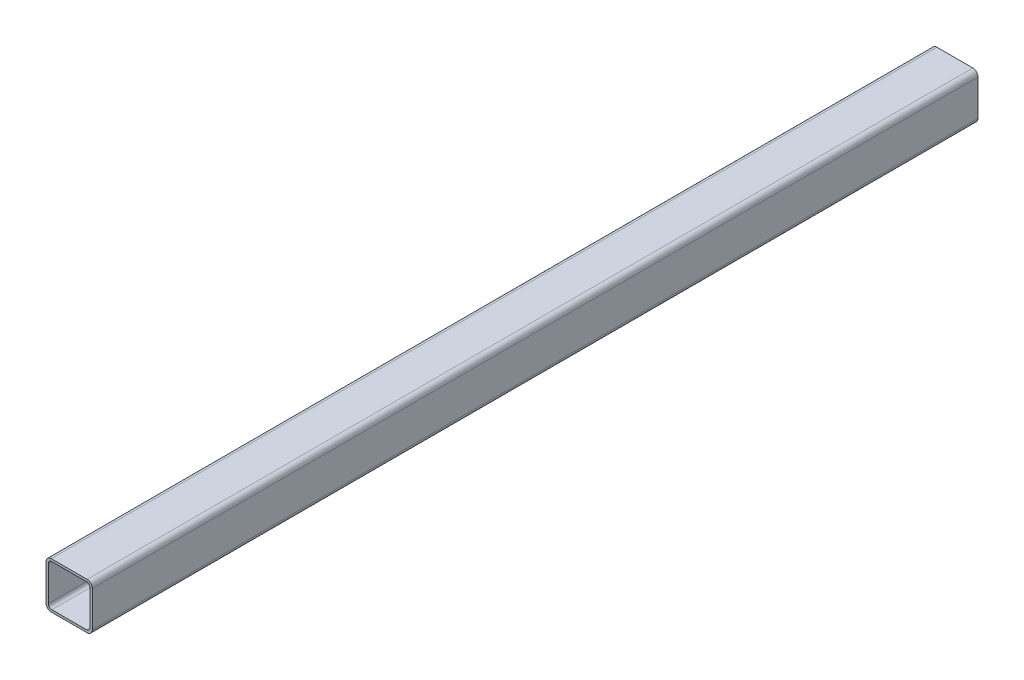
ISO-10303-21;
HEADER;
FILE_DESCRIPTION(('STEP AP214'),'2;1');
FILE_NAME('part.step','',(''),(''),'','','');
FILE_SCHEMA(('AUTOMOTIVE_DESIGN { 1 0 10303 214 1 1 1 1 }'));
ENDSEC;
DATA;
#1=APPLICATION_CONTEXT('core data for automotive mechanical design processes');
#2=APPLICATION_PROTOCOL_DEFINITION('international standard','automotive_design',2000,#1);
#3=PRODUCT_CONTEXT('',#1,'mechanical');
#4=PRODUCT('Part','Part','',(#3));
#5=PRODUCT_RELATED_PRODUCT_CATEGORY('part','',(#4));
#6=PRODUCT_DEFINITION_FORMATION('','',#4);
#7=PRODUCT_DEFINITION_CONTEXT('part definition',#1,'design');
#8=PRODUCT_DEFINITION('design','',#6,#7);
#9=PRODUCT_DEFINITION_SHAPE('','',#8);
#10=(LENGTH_UNIT() NAMED_UNIT(*) SI_UNIT(.MILLI.,.METRE.));
#11=(NAMED_UNIT(*) PLANE_ANGLE_UNIT() SI_UNIT($,.RADIAN.));
#12=(NAMED_UNIT(*) SI_UNIT($,.STERADIAN.) SOLID_ANGLE_UNIT());
#13=UNCERTAINTY_MEASURE_WITH_UNIT(LENGTH_MEASURE(1.E-05),#10,'distance_accuracy_value','');
#14=(GEOMETRIC_REPRESENTATION_CONTEXT(3) GLOBAL_UNCERTAINTY_ASSIGNED_CONTEXT((#13)) GLOBAL_UNIT_ASSIGNED_CONTEXT((#10,
#11,#12)) REPRESENTATION_CONTEXT('',''));
#15=CARTESIAN_POINT('',(0.,0.,0.));
#16=DIRECTION('',(0.,0.,1.));
#17=DIRECTION('',(1.,0.,0.));
#18=AXIS2_PLACEMENT_3D('',#15,#16,#17);
#19=CARTESIAN_POINT('',(-15.4999999999998,1249.00000000001,-2383.));
#20=DIRECTION('',(0.,1.00000000000001,0.));
#21=DIRECTION('',(0.,0.,1.));
#22=AXIS2_PLACEMENT_3D('',#19,#20,#21);
#23=PLANE('',#22);
#24=DIRECTION('',(-0.999999999999997,0.,0.));
#25=VECTOR('',#24,1.);
#26=CARTESIAN_POINT('',(-15.5000000000003,1249.00000000001,-2363.));
#27=LINE('',#26,#25);
#28=CARTESIAN_POINT('',(15.4999999999996,1249.00000000001,-2363.));
#29=VERTEX_POINT('',#28);
#30=CARTESIAN_POINT('',(-15.5000000000003,1249.00000000001,-2363.));
#31=VERTEX_POINT('',#30);
#32=EDGE_CURVE('E273',#29,#31,#27,.T.);
#33=ORIENTED_EDGE('',*,*,#32,.F.);
#34=DIRECTION('',(0.,0.,1.));
#35=VECTOR('',#34,1.);
#36=CARTESIAN_POINT('',(15.4999999999998,1249.00000000001,-2383.));
#37=LINE('',#36,#35);
#38=CARTESIAN_POINT('',(15.4999999999978,1249.00000000001,-1597.));
#39=VERTEX_POINT('',#38);
#40=EDGE_CURVE('E337',#29,#39,#37,.T.);
#41=ORIENTED_EDGE('',*,*,#40,.T.);
#42=DIRECTION('',(0.999999999999997,0.,0.));
#43=VECTOR('',#42,1.);
#44=CARTESIAN_POINT('',(-15.5000000000021,1249.00000000001,-1597.));
#45=LINE('',#44,#43);
#46=CARTESIAN_POINT('',(-15.5000000000021,1249.00000000001,-1597.));
#47=VERTEX_POINT('',#46);
#48=EDGE_CURVE('E204',#47,#39,#45,.T.);
#49=ORIENTED_EDGE('',*,*,#48,.F.);
#50=DIRECTION('',(0.,0.,1.));
#51=VECTOR('',#50,1.);
#52=CARTESIAN_POINT('',(-15.4999999999998,1249.00000000001,-2383.));
#53=LINE('',#52,#51);
#54=EDGE_CURVE('E47',#31,#47,#53,.T.);
#55=ORIENTED_EDGE('',*,*,#54,.F.);
#56=EDGE_LOOP('',(#33,#41,#49,#55));
#57=FACE_BOUND('',#56,.T.);
#58=ADVANCED_FACE('F43',(#57),#23,.F.);
#59=CARTESIAN_POINT('',(15.4999999999998,1253.50000000001,-2383.));
#60=DIRECTION('',(0.,0.,1.));
#61=DIRECTION('',(0.999999999999997,0.,0.));
#62=AXIS2_PLACEMENT_3D('',#59,#60,#61);
#63=CYLINDRICAL_SURFACE('',#62,4.5);
#64=CARTESIAN_POINT('',(15.4999999999996,1253.50000000001,-2363.));
#65=DIRECTION('',(0.,0.,-1.));
#66=DIRECTION('',(0.,1.00000000000001,0.));
#67=AXIS2_PLACEMENT_3D('',#64,#65,#66);
#68=CIRCLE('',#67,4.5);
#69=CARTESIAN_POINT('',(19.9999999999998,1253.50000000001,-2363.));
#70=VERTEX_POINT('',#69);
#71=EDGE_CURVE('E266',#70,#29,#68,.T.);
#72=ORIENTED_EDGE('',*,*,#71,.F.);
#73=DIRECTION('',(0.,0.,1.));
#74=VECTOR('',#73,1.);
#75=CARTESIAN_POINT('',(19.9999999999998,1253.50000000001,-2383.));
#76=LINE('',#75,#74);
#77=CARTESIAN_POINT('',(19.9999999999996,1253.50000000001,-1597.));
#78=VERTEX_POINT('',#77);
#79=EDGE_CURVE('E307',#70,#78,#76,.T.);
#80=ORIENTED_EDGE('',*,*,#79,.T.);
#81=CARTESIAN_POINT('',(15.4999999999996,1253.50000000001,-1597.));
#82=DIRECTION('',(0.,0.,1.));
#83=DIRECTION('',(0.,-1.00000000000001,0.));
#84=AXIS2_PLACEMENT_3D('',#81,#82,#83);
#85=CIRCLE('',#84,4.5);
#86=EDGE_CURVE('E210',#39,#78,#85,.T.);
#87=ORIENTED_EDGE('',*,*,#86,.F.);
#88=ORIENTED_EDGE('',*,*,#40,.F.);
#89=EDGE_LOOP('',(#72,#80,#87,#88));
#90=FACE_BOUND('',#89,.T.);
#91=ADVANCED_FACE('F348',(#90),#63,.T.);
#92=CARTESIAN_POINT('',(19.9999999999998,1253.50000000001,-2383.));
#93=DIRECTION('',(-0.999999999999997,0.,0.));
#94=DIRECTION('',(0.,0.,1.));
#95=AXIS2_PLACEMENT_3D('',#92,#93,#94);
#96=PLANE('',#95);
#97=DIRECTION('',(0.,1.00000000000001,0.));
#98=VECTOR('',#97,1.);
#99=CARTESIAN_POINT('',(19.9999999999994,3.88578058618805E-12,-2363.));
#100=LINE('',#99,#98);
#101=CARTESIAN_POINT('',(19.9999999999998,1284.50000000001,-2363.));
#102=VERTEX_POINT('',#101);
#103=EDGE_CURVE('E303',#70,#102,#100,.T.);
#104=ORIENTED_EDGE('',*,*,#103,.T.);
#105=DIRECTION('',(0.,0.,1.));
#106=VECTOR('',#105,1.);
#107=CARTESIAN_POINT('',(20.000000000002,1284.50000000001,-2383.));
#108=LINE('',#107,#106);
#109=CARTESIAN_POINT('',(20.,1284.50000000001,-1597.));
#110=VERTEX_POINT('',#109);
#111=EDGE_CURVE('E306',#102,#110,#108,.T.);
#112=ORIENTED_EDGE('',*,*,#111,.T.);
#113=DIRECTION('',(0.,1.00000000000001,0.));
#114=VECTOR('',#113,1.);
#115=CARTESIAN_POINT('',(19.9999999999996,2.22044604925031E-12,-1597.));
#116=LINE('',#115,#114);
#117=EDGE_CURVE('E220',#78,#110,#116,.T.);
#118=ORIENTED_EDGE('',*,*,#117,.F.);
#119=ORIENTED_EDGE('',*,*,#79,.F.);
#120=EDGE_LOOP('',(#104,#112,#118,#119));
#121=FACE_BOUND('',#120,.T.);
#122=ADVANCED_FACE('F351',(#121),#96,.F.);
#123=CARTESIAN_POINT('',(15.5000000000021,1284.50000000001,-2383.));
#124=DIRECTION('',(0.,0.,1.));
#125=DIRECTION('',(0.999999999999997,0.,0.));
#126=AXIS2_PLACEMENT_3D('',#123,#124,#125);
#127=CYLINDRICAL_SURFACE('',#126,4.5);
#128=CARTESIAN_POINT('',(15.4999999999998,1284.50000000001,-2363.));
#129=DIRECTION('',(0.,0.,-1.));
#130=DIRECTION('',(0.,1.00000000000001,0.));
#131=AXIS2_PLACEMENT_3D('',#128,#129,#130);
#132=CIRCLE('',#131,4.5);
#133=CARTESIAN_POINT('',(15.4999999999998,1289.00000000001,-2363.));
#134=VERTEX_POINT('',#133);
#135=EDGE_CURVE('E102',#134,#102,#132,.T.);
#136=ORIENTED_EDGE('',*,*,#135,.F.);
#137=DIRECTION('',(0.,0.,1.));
#138=VECTOR('',#137,1.);
#139=CARTESIAN_POINT('',(15.5000000000021,1289.00000000001,-2383.));
#140=LINE('',#139,#138);
#141=CARTESIAN_POINT('',(15.5000000000001,1289.00000000001,-1597.));
#142=VERTEX_POINT('',#141);
#143=EDGE_CURVE('E331',#134,#142,#140,.T.);
#144=ORIENTED_EDGE('',*,*,#143,.T.);
#145=CARTESIAN_POINT('',(15.5000000000001,1284.50000000001,-1597.));
#146=DIRECTION('',(0.,0.,1.));
#147=DIRECTION('',(0.,-1.00000000000001,0.));
#148=AXIS2_PLACEMENT_3D('',#145,#146,#147);
#149=CIRCLE('',#148,4.5);
#150=EDGE_CURVE('E216',#110,#142,#149,.T.);
#151=ORIENTED_EDGE('',*,*,#150,.F.);
#152=ORIENTED_EDGE('',*,*,#111,.F.);
#153=EDGE_LOOP('',(#136,#144,#151,#152));
#154=FACE_BOUND('',#153,.T.);
#155=ADVANCED_FACE('F357',(#154),#127,.T.);
#156=CARTESIAN_POINT('',(-15.4999999999981,1289.00000000001,-2383.));
#157=DIRECTION('',(0.,-1.00000000000001,0.));
#158=DIRECTION('',(0.,0.,-1.));
#159=AXIS2_PLACEMENT_3D('',#156,#157,#158);
#160=PLANE('',#159);
#161=DIRECTION('',(0.999999999999997,0.,0.));
#162=VECTOR('',#161,1.);
#163=CARTESIAN_POINT('',(-15.4999999999998,1289.00000000001,-2363.));
#164=LINE('',#163,#162);
#165=CARTESIAN_POINT('',(-15.4999999999998,1289.00000000001,-2363.));
#166=VERTEX_POINT('',#165);
#167=EDGE_CURVE('E11',#166,#134,#164,.T.);
#168=ORIENTED_EDGE('',*,*,#167,.F.);
#169=DIRECTION('',(0.,0.,1.));
#170=VECTOR('',#169,1.);
#171=CARTESIAN_POINT('',(-15.4999999999981,1289.00000000001,-2383.));
#172=LINE('',#171,#170);
#173=CARTESIAN_POINT('',(-15.5000000000001,1289.00000000001,-1597.));
#174=VERTEX_POINT('',#173);
#175=EDGE_CURVE('E328',#166,#174,#172,.T.);
#176=ORIENTED_EDGE('',*,*,#175,.T.);
#177=DIRECTION('',(-0.999999999999997,0.,0.));
#178=VECTOR('',#177,1.);
#179=CARTESIAN_POINT('',(-15.5000000000001,1289.00000000001,-1597.));
#180=LINE('',#179,#178);
#181=EDGE_CURVE('E267',#142,#174,#180,.T.);
#182=ORIENTED_EDGE('',*,*,#181,.F.);
#183=ORIENTED_EDGE('',*,*,#143,.F.);
#184=EDGE_LOOP('',(#168,#176,#182,#183));
#185=FACE_BOUND('',#184,.T.);
#186=ADVANCED_FACE('F450',(#185),#160,.F.);
#187=CARTESIAN_POINT('',(-15.4999999999981,1284.50000000001,-2383.));
#188=DIRECTION('',(0.,0.,1.));
#189=DIRECTION('',(0.999999999999997,0.,0.));
#190=AXIS2_PLACEMENT_3D('',#187,#188,#189);
#191=CYLINDRICAL_SURFACE('',#190,4.5);
#192=CARTESIAN_POINT('',(-15.5000000000001,1284.50000000001,-2363.));
#193=DIRECTION('',(0.,0.,-1.));
#194=DIRECTION('',(0.,1.00000000000001,0.));
#195=AXIS2_PLACEMENT_3D('',#192,#193,#194);
#196=CIRCLE('',#195,4.5);
#197=CARTESIAN_POINT('',(-20.,1284.50000000001,-2363.00000000001));
#198=VERTEX_POINT('',#197);
#199=EDGE_CURVE('E54',#198,#166,#196,.T.);
#200=ORIENTED_EDGE('',*,*,#199,.F.);
#201=DIRECTION('',(0.,0.,1.));
#202=VECTOR('',#201,1.);
#203=CARTESIAN_POINT('',(-19.999999999998,1284.50000000001,-2383.00000000001));
#204=LINE('',#203,#202);
#205=CARTESIAN_POINT('',(-20.,1284.50000000001,-1597.));
#206=VERTEX_POINT('',#205);
#207=EDGE_CURVE('E173',#198,#206,#204,.T.);
#208=ORIENTED_EDGE('',*,*,#207,.T.);
#209=CARTESIAN_POINT('',(-15.5000000000001,1284.50000000001,-1597.));
#210=DIRECTION('',(0.,0.,1.));
#211=DIRECTION('',(0.,-1.00000000000001,0.));
#212=AXIS2_PLACEMENT_3D('',#209,#210,#211);
#213=CIRCLE('',#212,4.5);
#214=EDGE_CURVE('E198',#174,#206,#213,.T.);
#215=ORIENTED_EDGE('',*,*,#214,.F.);
#216=ORIENTED_EDGE('',*,*,#175,.F.);
#217=EDGE_LOOP('',(#200,#208,#215,#216));
#218=FACE_BOUND('',#217,.T.);
#219=ADVANCED_FACE('F445',(#218),#191,.T.);
#220=CARTESIAN_POINT('',(-19.9999999999998,1253.50000000001,-2383.00000000001));
#221=DIRECTION('',(0.999999999999997,0.,0.));
#222=DIRECTION('',(0.,0.,-1.));
#223=AXIS2_PLACEMENT_3D('',#220,#221,#222);
#224=PLANE('',#223);
#225=DIRECTION('',(0.,1.00000000000001,0.));
#226=VECTOR('',#225,1.);
#227=CARTESIAN_POINT('',(-20.0000000000005,4.9960036108132E-12,-2363.));
#228=LINE('',#227,#226);
#229=CARTESIAN_POINT('',(-20.0000000000002,1253.50000000001,-2363.00000000001));
#230=VERTEX_POINT('',#229);
#231=EDGE_CURVE('E185',#230,#198,#228,.T.);
#232=ORIENTED_EDGE('',*,*,#231,.F.);
#233=DIRECTION('',(0.,0.,1.));
#234=VECTOR('',#233,1.);
#235=CARTESIAN_POINT('',(-19.9999999999998,1253.50000000001,-2383.00000000001));
#236=LINE('',#235,#234);
#237=CARTESIAN_POINT('',(-20.,1253.50000000001,-1597.));
#238=VERTEX_POINT('',#237);
#239=EDGE_CURVE('E181',#230,#238,#236,.T.);
#240=ORIENTED_EDGE('',*,*,#239,.T.);
#241=DIRECTION('',(0.,1.00000000000001,0.));
#242=VECTOR('',#241,1.);
#243=CARTESIAN_POINT('',(-20.0000000000005,3.33066907387547E-12,-1597.));
#244=LINE('',#243,#242);
#245=EDGE_CURVE('E184',#238,#206,#244,.T.);
#246=ORIENTED_EDGE('',*,*,#245,.T.);
#247=ORIENTED_EDGE('',*,*,#207,.F.);
#248=EDGE_LOOP('',(#232,#240,#246,#247));
#249=FACE_BOUND('',#248,.T.);
#250=ADVANCED_FACE('F183',(#249),#224,.F.);
#251=CARTESIAN_POINT('',(-15.4999999999998,1253.50000000001,-2383.));
#252=DIRECTION('',(0.,0.,1.));
#253=DIRECTION('',(0.999999999999997,0.,0.));
#254=AXIS2_PLACEMENT_3D('',#251,#252,#253);
#255=CYLINDRICAL_SURFACE('',#254,4.5);
#256=CARTESIAN_POINT('',(-15.5000000000003,1253.50000000001,-2363.));
#257=DIRECTION('',(0.,0.,-1.));
#258=DIRECTION('',(0.,1.00000000000001,0.));
#259=AXIS2_PLACEMENT_3D('',#256,#257,#258);
#260=CIRCLE('',#259,4.5);
#261=EDGE_CURVE('E277',#31,#230,#260,.T.);
#262=ORIENTED_EDGE('',*,*,#261,.F.);
#263=ORIENTED_EDGE('',*,*,#54,.T.);
#264=CARTESIAN_POINT('',(-15.5000000000001,1253.50000000001,-1597.));
#265=DIRECTION('',(0.,0.,1.));
#266=DIRECTION('',(0.,-1.00000000000001,0.));
#267=AXIS2_PLACEMENT_3D('',#264,#265,#266);
#268=CIRCLE('',#267,4.5);
#269=EDGE_CURVE('E195',#238,#47,#268,.T.);
#270=ORIENTED_EDGE('',*,*,#269,.F.);
#271=ORIENTED_EDGE('',*,*,#239,.F.);
#272=EDGE_LOOP('',(#262,#263,#270,#271));
#273=FACE_BOUND('',#272,.T.);
#274=ADVANCED_FACE('F201',(#273),#255,.T.);
#275=CARTESIAN_POINT('',(-17.9999999999998,1254.00000000001,-2383.));
#276=DIRECTION('',(0.999999999999997,0.,0.));
#277=DIRECTION('',(0.,0.,-1.));
#278=AXIS2_PLACEMENT_3D('',#275,#276,#277);
#279=PLANE('',#278);
#280=DIRECTION('',(0.,0.,1.));
#281=VECTOR('',#280,1.);
#282=CARTESIAN_POINT('',(-17.9999999999998,1254.00000000001,-2383.));
#283=LINE('',#282,#281);
#284=CARTESIAN_POINT('',(-18.0000000000002,1254.00000000001,-2363.));
#285=VERTEX_POINT('',#284);
#286=CARTESIAN_POINT('',(-18.,1254.00000000001,-1597.));
#287=VERTEX_POINT('',#286);
#288=EDGE_CURVE('E225',#285,#287,#283,.T.);
#289=ORIENTED_EDGE('',*,*,#288,.F.);
#290=DIRECTION('',(0.,1.00000000000001,0.));
#291=VECTOR('',#290,1.);
#292=CARTESIAN_POINT('',(-18.0000000000002,1254.00000000001,-2363.));
#293=LINE('',#292,#291);
#294=CARTESIAN_POINT('',(-18.,1284.00000000001,-2363.));
#295=VERTEX_POINT('',#294);
#296=EDGE_CURVE('E108',#285,#295,#293,.T.);
#297=ORIENTED_EDGE('',*,*,#296,.T.);
#298=DIRECTION('',(0.,0.,1.));
#299=VECTOR('',#298,1.);
#300=CARTESIAN_POINT('',(-17.999999999998,1284.00000000001,-2383.));
#301=LINE('',#300,#299);
#302=CARTESIAN_POINT('',(-18.,1284.00000000001,-1597.));
#303=VERTEX_POINT('',#302);
#304=EDGE_CURVE('E282',#295,#303,#301,.T.);
#305=ORIENTED_EDGE('',*,*,#304,.T.);
#306=DIRECTION('',(0.,-1.00000000000001,0.));
#307=VECTOR('',#306,1.);
#308=CARTESIAN_POINT('',(-18.,1254.00000000001,-1597.));
#309=LINE('',#308,#307);
#310=EDGE_CURVE('E287',#303,#287,#309,.T.);
#311=ORIENTED_EDGE('',*,*,#310,.T.);
#312=EDGE_LOOP('',(#289,#297,#305,#311));
#313=FACE_BOUND('',#312,.T.);
#314=ADVANCED_FACE('F45',(#313),#279,.T.);
#315=CARTESIAN_POINT('',(-14.9999999999979,1284.00000000001,-2383.));
#316=DIRECTION('',(0.,0.,1.));
#317=DIRECTION('',(0.999999999999997,0.,0.));
#318=AXIS2_PLACEMENT_3D('',#315,#316,#317);
#319=CYLINDRICAL_SURFACE('',#318,3.);
#320=ORIENTED_EDGE('',*,*,#304,.F.);
#321=CARTESIAN_POINT('',(-15.0000000000001,1284.00000000001,-2363.));
#322=DIRECTION('',(0.,0.,-1.));
#323=DIRECTION('',(0.,1.00000000000001,0.));
#324=AXIS2_PLACEMENT_3D('',#321,#322,#323);
#325=CIRCLE('',#324,3.);
#326=CARTESIAN_POINT('',(-14.9999999999999,1287.00000000001,-2363.));
#327=VERTEX_POINT('',#326);
#328=EDGE_CURVE('E283',#295,#327,#325,.T.);
#329=ORIENTED_EDGE('',*,*,#328,.T.);
#330=DIRECTION('',(0.,0.,1.));
#331=VECTOR('',#330,1.);
#332=CARTESIAN_POINT('',(-14.9999999999979,1287.00000000001,-2383.));
#333=LINE('',#332,#331);
#334=CARTESIAN_POINT('',(-14.9999999999999,1287.00000000001,-1597.));
#335=VERTEX_POINT('',#334);
#336=EDGE_CURVE('E260',#327,#335,#333,.T.);
#337=ORIENTED_EDGE('',*,*,#336,.T.);
#338=CARTESIAN_POINT('',(-14.9999999999999,1284.00000000001,-1597.));
#339=DIRECTION('',(0.,0.,1.));
#340=DIRECTION('',(0.,-1.00000000000001,0.));
#341=AXIS2_PLACEMENT_3D('',#338,#339,#340);
#342=CIRCLE('',#341,3.);
#343=EDGE_CURVE('E256',#335,#303,#342,.T.);
#344=ORIENTED_EDGE('',*,*,#343,.T.);
#345=EDGE_LOOP('',(#320,#329,#337,#344));
#346=FACE_BOUND('',#345,.T.);
#347=ADVANCED_FACE('F384',(#346),#319,.F.);
#348=CARTESIAN_POINT('',(-14.9999999999979,1287.00000000001,-2383.));
#349=DIRECTION('',(0.,-1.00000000000001,0.));
#350=DIRECTION('',(0.,0.,-1.));
#351=AXIS2_PLACEMENT_3D('',#348,#349,#350);
#352=PLANE('',#351);
#353=ORIENTED_EDGE('',*,*,#336,.F.);
#354=DIRECTION('',(0.999999999999997,0.,0.));
#355=VECTOR('',#354,1.);
#356=CARTESIAN_POINT('',(-14.9999999999999,1287.00000000001,-2363.));
#357=LINE('',#356,#355);
#358=CARTESIAN_POINT('',(14.9999999999999,1287.00000000001,-2363.00000000001));
#359=VERTEX_POINT('',#358);
#360=EDGE_CURVE('E259',#327,#359,#357,.T.);
#361=ORIENTED_EDGE('',*,*,#360,.T.);
#362=DIRECTION('',(0.,0.,1.));
#363=VECTOR('',#362,1.);
#364=CARTESIAN_POINT('',(15.0000000000019,1287.00000000001,-2383.00000000001));
#365=LINE('',#364,#363);
#366=CARTESIAN_POINT('',(15.0000000000001,1287.00000000001,-1597.));
#367=VERTEX_POINT('',#366);
#368=EDGE_CURVE('E255',#359,#367,#365,.T.);
#369=ORIENTED_EDGE('',*,*,#368,.T.);
#370=DIRECTION('',(-0.999999999999997,0.,0.));
#371=VECTOR('',#370,1.);
#372=CARTESIAN_POINT('',(-14.9999999999999,1287.00000000001,-1597.));
#373=LINE('',#372,#371);
#374=EDGE_CURVE('E250',#367,#335,#373,.T.);
#375=ORIENTED_EDGE('',*,*,#374,.T.);
#376=EDGE_LOOP('',(#353,#361,#369,#375));
#377=FACE_BOUND('',#376,.T.);
#378=ADVANCED_FACE('F387',(#377),#352,.T.);
#379=CARTESIAN_POINT('',(15.0000000000019,1284.00000000001,-2383.00000000001));
#380=DIRECTION('',(0.,0.,1.));
#381=DIRECTION('',(0.999999999999997,0.,0.));
#382=AXIS2_PLACEMENT_3D('',#379,#380,#381);
#383=CYLINDRICAL_SURFACE('',#382,3.);
#384=ORIENTED_EDGE('',*,*,#368,.F.);
#385=CARTESIAN_POINT('',(14.9999999999999,1284.00000000001,-2363.00000000001));
#386=DIRECTION('',(0.,0.,-1.));
#387=DIRECTION('',(0.,1.00000000000001,0.));
#388=AXIS2_PLACEMENT_3D('',#385,#386,#387);
#389=CIRCLE('',#388,3.);
#390=CARTESIAN_POINT('',(17.9999999999998,1284.00000000001,-2363.00000000001));
#391=VERTEX_POINT('',#390);
#392=EDGE_CURVE('E254',#359,#391,#389,.T.);
#393=ORIENTED_EDGE('',*,*,#392,.T.);
#394=DIRECTION('',(0.,0.,1.));
#395=VECTOR('',#394,1.);
#396=CARTESIAN_POINT('',(18.000000000002,1284.00000000001,-2383.00000000001));
#397=LINE('',#396,#395);
#398=CARTESIAN_POINT('',(18.,1284.00000000001,-1597.));
#399=VERTEX_POINT('',#398);
#400=EDGE_CURVE('E249',#391,#399,#397,.T.);
#401=ORIENTED_EDGE('',*,*,#400,.T.);
#402=CARTESIAN_POINT('',(14.9999999999999,1284.00000000001,-1597.));
#403=DIRECTION('',(0.,0.,1.));
#404=DIRECTION('',(0.,-1.00000000000001,0.));
#405=AXIS2_PLACEMENT_3D('',#402,#403,#404);
#406=CIRCLE('',#405,3.);
#407=EDGE_CURVE('E244',#399,#367,#406,.T.);
#408=ORIENTED_EDGE('',*,*,#407,.T.);
#409=EDGE_LOOP('',(#384,#393,#401,#408));
#410=FACE_BOUND('',#409,.T.);
#411=ADVANCED_FACE('F392',(#410),#383,.F.);
#412=CARTESIAN_POINT('',(17.9999999999998,1254.00000000001,-2383.00000000001));
#413=DIRECTION('',(-0.999999999999997,0.,0.));
#414=DIRECTION('',(0.,0.,1.));
#415=AXIS2_PLACEMENT_3D('',#412,#413,#414);
#416=PLANE('',#415);
#417=ORIENTED_EDGE('',*,*,#400,.F.);
#418=DIRECTION('',(0.,-1.00000000000001,0.));
#419=VECTOR('',#418,1.);
#420=CARTESIAN_POINT('',(17.9999999999998,1254.00000000001,-2363.00000000001));
#421=LINE('',#420,#419);
#422=CARTESIAN_POINT('',(17.9999999999998,1254.00000000001,-2363.00000000001));
#423=VERTEX_POINT('',#422);
#424=EDGE_CURVE('E248',#391,#423,#421,.T.);
#425=ORIENTED_EDGE('',*,*,#424,.T.);
#426=DIRECTION('',(0.,0.,1.));
#427=VECTOR('',#426,1.);
#428=CARTESIAN_POINT('',(17.9999999999998,1254.00000000001,-2383.00000000001));
#429=LINE('',#428,#427);
#430=CARTESIAN_POINT('',(17.9999999999996,1254.00000000001,-1597.));
#431=VERTEX_POINT('',#430);
#432=EDGE_CURVE('E243',#423,#431,#429,.T.);
#433=ORIENTED_EDGE('',*,*,#432,.T.);
#434=DIRECTION('',(0.,1.00000000000001,0.));
#435=VECTOR('',#434,1.);
#436=CARTESIAN_POINT('',(17.9999999999996,1254.00000000001,-1597.));
#437=LINE('',#436,#435);
#438=EDGE_CURVE('E238',#431,#399,#437,.T.);
#439=ORIENTED_EDGE('',*,*,#438,.T.);
#440=EDGE_LOOP('',(#417,#425,#433,#439));
#441=FACE_BOUND('',#440,.T.);
#442=ADVANCED_FACE('F395',(#441),#416,.T.);
#443=CARTESIAN_POINT('',(14.9999999999999,1254.00000000001,-2383.00000000001));
#444=DIRECTION('',(0.,0.,1.));
#445=DIRECTION('',(0.999999999999997,0.,0.));
#446=AXIS2_PLACEMENT_3D('',#443,#444,#445);
#447=CYLINDRICAL_SURFACE('',#446,3.);
#448=ORIENTED_EDGE('',*,*,#432,.F.);
#449=CARTESIAN_POINT('',(14.9999999999997,1254.00000000001,-2363.00000000001));
#450=DIRECTION('',(0.,0.,-1.));
#451=DIRECTION('',(0.,1.00000000000001,0.));
#452=AXIS2_PLACEMENT_3D('',#449,#450,#451);
#453=CIRCLE('',#452,3.);
#454=CARTESIAN_POINT('',(14.9999999999997,1251.00000000001,-2363.00000000001));
#455=VERTEX_POINT('',#454);
#456=EDGE_CURVE('E242',#423,#455,#453,.T.);
#457=ORIENTED_EDGE('',*,*,#456,.T.);
#458=DIRECTION('',(0.,0.,1.));
#459=VECTOR('',#458,1.);
#460=CARTESIAN_POINT('',(14.9999999999999,1251.00000000001,-2383.00000000001));
#461=LINE('',#460,#459);
#462=CARTESIAN_POINT('',(14.9999999999979,1251.00000000001,-1597.));
#463=VERTEX_POINT('',#462);
#464=EDGE_CURVE('E237',#455,#463,#461,.T.);
#465=ORIENTED_EDGE('',*,*,#464,.T.);
#466=CARTESIAN_POINT('',(14.9999999999997,1254.00000000001,-1597.));
#467=DIRECTION('',(0.,0.,1.));
#468=DIRECTION('',(0.,-1.00000000000001,0.));
#469=AXIS2_PLACEMENT_3D('',#466,#467,#468);
#470=CIRCLE('',#469,3.);
#471=EDGE_CURVE('E232',#463,#431,#470,.T.);
#472=ORIENTED_EDGE('',*,*,#471,.T.);
#473=EDGE_LOOP('',(#448,#457,#465,#472));
#474=FACE_BOUND('',#473,.T.);
#475=ADVANCED_FACE('F399',(#474),#447,.F.);
#476=CARTESIAN_POINT('',(-14.9999999999999,1251.00000000001,-2383.));
#477=DIRECTION('',(0.,1.00000000000001,0.));
#478=DIRECTION('',(0.,0.,1.));
#479=AXIS2_PLACEMENT_3D('',#476,#477,#478);
#480=PLANE('',#479);
#481=ORIENTED_EDGE('',*,*,#464,.F.);
#482=DIRECTION('',(-0.999999999999997,0.,0.));
#483=VECTOR('',#482,1.);
#484=CARTESIAN_POINT('',(-15.0000000000003,1251.00000000001,-2363.));
#485=LINE('',#484,#483);
#486=CARTESIAN_POINT('',(-15.0000000000003,1251.00000000001,-2363.));
#487=VERTEX_POINT('',#486);
#488=EDGE_CURVE('E236',#455,#487,#485,.T.);
#489=ORIENTED_EDGE('',*,*,#488,.T.);
#490=DIRECTION('',(0.,0.,1.));
#491=VECTOR('',#490,1.);
#492=CARTESIAN_POINT('',(-14.9999999999999,1251.00000000001,-2383.));
#493=LINE('',#492,#491);
#494=CARTESIAN_POINT('',(-15.0000000000021,1251.00000000001,-1597.));
#495=VERTEX_POINT('',#494);
#496=EDGE_CURVE('E231',#487,#495,#493,.T.);
#497=ORIENTED_EDGE('',*,*,#496,.T.);
#498=DIRECTION('',(0.999999999999997,0.,0.));
#499=VECTOR('',#498,1.);
#500=CARTESIAN_POINT('',(-15.0000000000021,1251.00000000001,-1597.));
#501=LINE('',#500,#499);
#502=EDGE_CURVE('E226',#495,#463,#501,.T.);
#503=ORIENTED_EDGE('',*,*,#502,.T.);
#504=EDGE_LOOP('',(#481,#489,#497,#503));
#505=FACE_BOUND('',#504,.T.);
#506=ADVANCED_FACE('F402',(#505),#480,.T.);
#507=CARTESIAN_POINT('',(-14.9999999999999,1254.00000000001,-2383.));
#508=DIRECTION('',(0.,0.,1.));
#509=DIRECTION('',(0.999999999999997,0.,0.));
#510=AXIS2_PLACEMENT_3D('',#507,#508,#509);
#511=CYLINDRICAL_SURFACE('',#510,3.);
#512=ORIENTED_EDGE('',*,*,#496,.F.);
#513=CARTESIAN_POINT('',(-15.0000000000003,1254.00000000001,-2363.));
#514=DIRECTION('',(0.,0.,-1.));
#515=DIRECTION('',(0.,1.00000000000001,0.));
#516=AXIS2_PLACEMENT_3D('',#513,#514,#515);
#517=CIRCLE('',#516,3.);
#518=EDGE_CURVE('E230',#487,#285,#517,.T.);
#519=ORIENTED_EDGE('',*,*,#518,.T.);
#520=ORIENTED_EDGE('',*,*,#288,.T.);
#521=CARTESIAN_POINT('',(-15.0000000000001,1254.00000000001,-1597.));
#522=DIRECTION('',(0.,0.,1.));
#523=DIRECTION('',(0.,-1.00000000000001,0.));
#524=AXIS2_PLACEMENT_3D('',#521,#522,#523);
#525=CIRCLE('',#524,3.);
#526=EDGE_CURVE('E212',#287,#495,#525,.T.);
#527=ORIENTED_EDGE('',*,*,#526,.T.);
#528=EDGE_LOOP('',(#512,#519,#520,#527));
#529=FACE_BOUND('',#528,.T.);
#530=ADVANCED_FACE('F374',(#529),#511,.F.);
#531=CARTESIAN_POINT('',(-15.5000000000005,3.21964677141295E-12,-1597.));
#532=DIRECTION('',(0.,0.,1.));
#533=DIRECTION('',(0.,-1.00000000000001,0.));
#534=AXIS2_PLACEMENT_3D('',#531,#532,#533);
#535=PLANE('',#534);
#536=ORIENTED_EDGE('',*,*,#310,.F.);
#537=ORIENTED_EDGE('',*,*,#343,.F.);
#538=ORIENTED_EDGE('',*,*,#374,.F.);
#539=ORIENTED_EDGE('',*,*,#407,.F.);
#540=ORIENTED_EDGE('',*,*,#438,.F.);
#541=ORIENTED_EDGE('',*,*,#471,.F.);
#542=ORIENTED_EDGE('',*,*,#502,.F.);
#543=ORIENTED_EDGE('',*,*,#526,.F.);
#544=EDGE_LOOP('',(#536,#537,#538,#539,#540,#541,#542,#543));
#545=FACE_BOUND('',#544,.T.);
#546=ORIENTED_EDGE('',*,*,#214,.T.);
#547=ORIENTED_EDGE('',*,*,#245,.F.);
#548=ORIENTED_EDGE('',*,*,#269,.T.);
#549=ORIENTED_EDGE('',*,*,#48,.T.);
#550=ORIENTED_EDGE('',*,*,#86,.T.);
#551=ORIENTED_EDGE('',*,*,#117,.T.);
#552=ORIENTED_EDGE('',*,*,#150,.T.);
#553=ORIENTED_EDGE('',*,*,#181,.T.);
#554=EDGE_LOOP('',(#546,#547,#548,#549,#550,#551,#552,#553));
#555=FACE_BOUND('',#554,.T.);
#556=ADVANCED_FACE('F193',(#545,#555),#535,.T.);
#557=CARTESIAN_POINT('',(-15.5000000000005,4.88498130835069E-12,-2363.));
#558=DIRECTION('',(0.,0.,-1.));
#559=DIRECTION('',(0.,1.00000000000001,0.));
#560=AXIS2_PLACEMENT_3D('',#557,#558,#559);
#561=PLANE('',#560);
#562=ORIENTED_EDGE('',*,*,#518,.F.);
#563=ORIENTED_EDGE('',*,*,#488,.F.);
#564=ORIENTED_EDGE('',*,*,#456,.F.);
#565=ORIENTED_EDGE('',*,*,#424,.F.);
#566=ORIENTED_EDGE('',*,*,#392,.F.);
#567=ORIENTED_EDGE('',*,*,#360,.F.);
#568=ORIENTED_EDGE('',*,*,#328,.F.);
#569=ORIENTED_EDGE('',*,*,#296,.F.);
#570=EDGE_LOOP('',(#562,#563,#564,#565,#566,#567,#568,#569));
#571=FACE_BOUND('',#570,.T.);
#572=ORIENTED_EDGE('',*,*,#135,.T.);
#573=ORIENTED_EDGE('',*,*,#103,.F.);
#574=ORIENTED_EDGE('',*,*,#71,.T.);
#575=ORIENTED_EDGE('',*,*,#32,.T.);
#576=ORIENTED_EDGE('',*,*,#261,.T.);
#577=ORIENTED_EDGE('',*,*,#231,.T.);
#578=ORIENTED_EDGE('',*,*,#199,.T.);
#579=ORIENTED_EDGE('',*,*,#167,.T.);
#580=EDGE_LOOP('',(#572,#573,#574,#575,#576,#577,#578,#579));
#581=FACE_BOUND('',#580,.T.);
#582=ADVANCED_FACE('F403',(#571,#581),#561,.T.);
#583=CLOSED_SHELL('',(#58,#91,#122,#155,#186,#219,#250,#274,#314,#347,#378,#411,#442,#475,#506,
#530,#556,#582));
#584=MANIFOLD_SOLID_BREP('B2',#583);
#585=ADVANCED_BREP_SHAPE_REPRESENTATION('',(#18,#584),#14);
#586=SHAPE_DEFINITION_REPRESENTATION(#9,#585);
ENDSEC;
END-ISO-10303-21;
